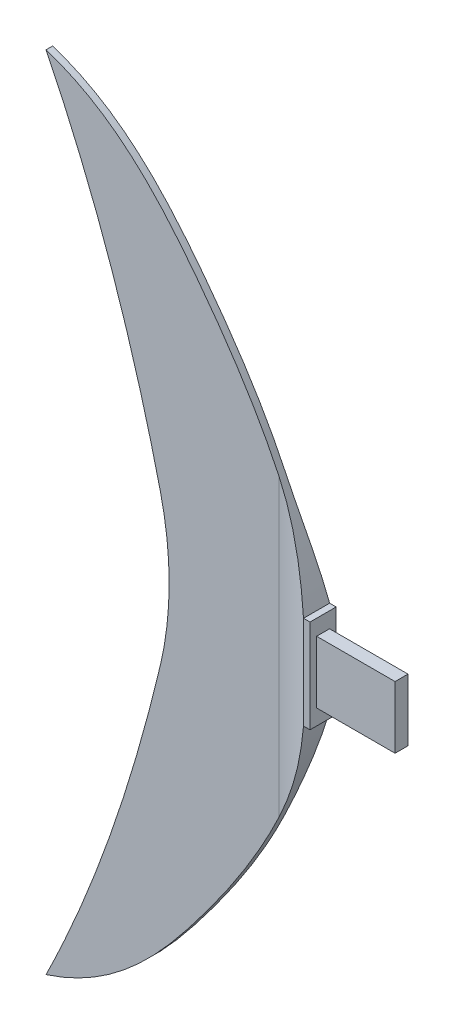
ISO-10303-21;
HEADER;
FILE_DESCRIPTION(('STEP AP214'),'2;1');
FILE_NAME('part.step','',(''),(''),'','','');
FILE_SCHEMA(('AUTOMOTIVE_DESIGN { 1 0 10303 214 1 1 1 1 }'));
ENDSEC;
DATA;
#1=APPLICATION_CONTEXT('core data for automotive mechanical design processes');
#2=APPLICATION_PROTOCOL_DEFINITION('international standard','automotive_design',2000,#1);
#3=PRODUCT_CONTEXT('',#1,'mechanical');
#4=PRODUCT('Part','Part','',(#3));
#5=PRODUCT_RELATED_PRODUCT_CATEGORY('part','',(#4));
#6=PRODUCT_DEFINITION_FORMATION('','',#4);
#7=PRODUCT_DEFINITION_CONTEXT('part definition',#1,'design');
#8=PRODUCT_DEFINITION('design','',#6,#7);
#9=PRODUCT_DEFINITION_SHAPE('','',#8);
#10=(LENGTH_UNIT() NAMED_UNIT(*) SI_UNIT(.MILLI.,.METRE.));
#11=(NAMED_UNIT(*) PLANE_ANGLE_UNIT() SI_UNIT($,.RADIAN.));
#12=(NAMED_UNIT(*) SI_UNIT($,.STERADIAN.) SOLID_ANGLE_UNIT());
#13=UNCERTAINTY_MEASURE_WITH_UNIT(LENGTH_MEASURE(1.E-05),#10,'distance_accuracy_value','');
#14=(GEOMETRIC_REPRESENTATION_CONTEXT(3) GLOBAL_UNCERTAINTY_ASSIGNED_CONTEXT((#13)) GLOBAL_UNIT_ASSIGNED_CONTEXT((#10,
#11,#12)) REPRESENTATION_CONTEXT('',''));
#15=CARTESIAN_POINT('',(0.,0.,0.));
#16=DIRECTION('',(0.,0.,1.));
#17=DIRECTION('',(1.,0.,0.));
#18=AXIS2_PLACEMENT_3D('',#15,#16,#17);
#19=CARTESIAN_POINT('',(-41.875,-61.25,-0.5));
#20=CARTESIAN_POINT('',(-31.5874842784891,-57.9418836886526,-0.5));
#21=CARTESIAN_POINT('',(-14.3282682069609,-38.8723925230589,-0.5));
#22=CARTESIAN_POINT('',(-1.21117209617891,-16.1164014084701,-0.5));
#23=CARTESIAN_POINT('',(0.,0.,-0.5));
#24=B_SPLINE_CURVE_WITH_KNOTS('',3,(#19,#20,#21,#22,#23),.UNSPECIFIED.,.F.,.F.,(4,1,4),(0.,
0.390169789685877,1.),.UNSPECIFIED.);
#25=DIRECTION('',(0.,0.,1.));
#26=VECTOR('',#25,1.);
#27=SURFACE_OF_LINEAR_EXTRUSION('',#24,#26);
#28=CARTESIAN_POINT('',(-41.875,-61.25,-0.5));
#29=VERTEX_POINT('',#28);
#30=CARTESIAN_POINT('',(-6.26035934816506,-22.6217568444581,-0.5));
#31=VERTEX_POINT('',#30);
#32=EDGE_CURVE('E253',#29,#31,#24,.T.);
#33=ORIENTED_EDGE('',*,*,#32,.T.);
#34=CARTESIAN_POINT('',(-6.26035934021112,-22.6217568482344,-0.5));
#35=CARTESIAN_POINT('',(-6.06303837023028,-22.2061514161493,-0.500008799848662));
#36=CARTESIAN_POINT('',(-5.8692962912311,-21.7888749438555,-0.505839641256225));
#37=CARTESIAN_POINT('',(-5.48991552133412,-20.9524460311061,-0.527916298525936));
#38=CARTESIAN_POINT('',(-5.30425408966573,-20.5333030843551,-0.544130554403684));
#39=CARTESIAN_POINT('',(-4.94118083785616,-19.6930135175768,-0.585713833233017));
#40=CARTESIAN_POINT('',(-4.76375180606703,-19.27187331416,-0.611062685494451));
#41=CARTESIAN_POINT('',(-4.41728500481613,-18.427449275693,-0.669745518831748));
#42=CARTESIAN_POINT('',(-4.24823510715106,-18.0041695779003,-0.703067526172686));
#43=CARTESIAN_POINT('',(-3.91867867166206,-17.155330578039,-0.776574308453235));
#44=CARTESIAN_POINT('',(-3.75816465229777,-16.7297736444612,-0.816752939179432));
#45=CARTESIAN_POINT('',(-3.44583812336753,-15.8762421683627,-0.902880570729147));
#46=CARTESIAN_POINT('',(-3.29402241294207,-15.4482685796588,-0.948827428801874));
#47=CARTESIAN_POINT('',(-2.99933800040708,-14.5899974922843,-1.04538374202225));
#48=CARTESIAN_POINT('',(-2.85646525584853,-14.1597011405151,-1.0959910645793));
#49=CARTESIAN_POINT('',(-2.57973544765812,-13.2963687566669,-1.20081121305003));
#50=CARTESIAN_POINT('',(-2.44588384139626,-12.8633312365269,-1.25502618270716));
#51=CARTESIAN_POINT('',(-2.18736672561728,-11.9943293327164,-1.36596821901394));
#52=CARTESIAN_POINT('',(-2.06271123893371,-11.5583623045509,-1.42269792177025));
#53=CARTESIAN_POINT('',(-1.82276785450447,-10.6833080099514,-1.5375504912027));
#54=CARTESIAN_POINT('',(-1.7074946561631,-10.2442169763599,-1.59567536602246));
#55=CARTESIAN_POINT('',(-1.48650952551611,-9.36271212395287,-1.7121682728485));
#56=CARTESIAN_POINT('',(-1.38081726807849,-8.92029340170838,-1.77053655876187));
#57=CARTESIAN_POINT('',(-1.17919938142418,-8.03192766807165,-1.8863260311618));
#58=CARTESIAN_POINT('',(-1.08329892510835,-7.58597458887117,-1.94374447357079));
#59=CARTESIAN_POINT('',(-0.992532463784746,-7.13882445,-2.));
#60=B_SPLINE_CURVE_WITH_KNOTS('',3,(#34,#35,#36,#37,#38,#39,#40,#41,#42,#43,#44,#45,#46,#47,#48,
#49,#50,#51,#52,#53,#54,#55,#56,#57,#58,#59),.UNSPECIFIED.,.F.,.F.,(4,2,2,2,2,2,2,2,2,2,2,2,4),
(0.,1.38011650132367,2.75605797447415,4.12897957588325,5.4998521830644,6.86950274194032,
8.23864600743303,9.60716584802514,10.9765062832197,12.3473177616643,13.7202371526974,
15.0959148802064,16.4750445958695),.UNSPECIFIED.);
#61=CARTESIAN_POINT('',(-0.992532463784747,-7.13882445,-2.));
#62=VERTEX_POINT('',#61);
#63=EDGE_CURVE('E54',#31,#62,#60,.T.);
#64=ORIENTED_EDGE('',*,*,#63,.T.);
#65=DIRECTION('',(0.,0.,-1.));
#66=VECTOR('',#65,1.);
#67=CARTESIAN_POINT('',(-0.992532463784747,-7.13882445,2.));
#68=LINE('',#67,#66);
#69=CARTESIAN_POINT('',(-0.992532463784747,-7.13882445,2.));
#70=VERTEX_POINT('',#69);
#71=EDGE_CURVE('E187',#70,#62,#68,.T.);
#72=ORIENTED_EDGE('',*,*,#71,.F.);
#73=CARTESIAN_POINT('',(-0.992532463784747,-7.13882445,2.));
#74=CARTESIAN_POINT('',(-1.08329892512268,-7.58597458894179,1.9437444735619));
#75=CARTESIAN_POINT('',(-1.17919938145447,-8.03192766821252,1.88632603114366));
#76=CARTESIAN_POINT('',(-1.38081726814159,-8.92029340197903,1.77053655872637));
#77=CARTESIAN_POINT('',(-1.48650952559583,-9.36271212428311,1.71216827280492));
#78=CARTESIAN_POINT('',(-1.70749465627621,-10.2442169767989,1.59567536596439));
#79=CARTESIAN_POINT('',(-1.82276785463412,-10.6833080104396,1.53755049113823));
#80=CARTESIAN_POINT('',(-2.06271123909597,-11.5583623051273,1.42269792169499));
#81=CARTESIAN_POINT('',(-2.18736672579539,-11.9943293333318,1.36596821893429));
#82=CARTESIAN_POINT('',(-2.44588384160459,-12.8633312372105,1.25502618262097));
#83=CARTESIAN_POINT('',(-2.5797354478806,-13.2963687573797,1.20081121296163));
#84=CARTESIAN_POINT('',(-2.85646525609843,-14.159701141276,1.09599106448877));
#85=CARTESIAN_POINT('',(-2.99933800067002,-14.5899974930642,1.04538374193172));
#86=CARTESIAN_POINT('',(-3.29402241323577,-15.4482685805001,0.948827428710009));
#87=CARTESIAN_POINT('',(-3.44583812367941,-15.8762421692463,0.902880570636185));
#88=CARTESIAN_POINT('',(-3.75816465266117,-16.7297736454229,0.816752939086188));
#89=CARTESIAN_POINT('',(-3.91867867205883,-17.1553305790365,0.77657430836081));
#90=CARTESIAN_POINT('',(-4.24823510756566,-18.0041695789927,0.703067526084143));
#91=CARTESIAN_POINT('',(-4.41728500521516,-18.4274492768445,0.669745518746279));
#92=CARTESIAN_POINT('',(-4.76375180662571,-19.2718733153424,0.611062685417736));
#93=CARTESIAN_POINT('',(-4.94118083859035,-19.6930135187305,0.585713833162002));
#94=CARTESIAN_POINT('',(-5.30425409004542,-20.5333030857805,0.5441305543471));
#95=CARTESIAN_POINT('',(-5.48991552118228,-20.9524460328323,0.527916298478112));
#96=CARTESIAN_POINT('',(-5.86929629272279,-21.788874945077,0.505839641226235));
#97=CARTESIAN_POINT('',(-6.06303837390731,-22.2061514165606,0.50000879983085));
#98=CARTESIAN_POINT('',(-6.26035934910116,-22.6217568464297,0.499999999999998));
#99=B_SPLINE_CURVE_WITH_KNOTS('',3,(#73,#74,#75,#76,#77,#78,#79,#80,#81,#82,#83,#84,#85,#86,#87,
#88,#89,#90,#91,#92,#93,#94,#95,#96,#97,#98),.UNSPECIFIED.,.F.,.F.,(4,2,2,2,2,2,2,2,2,2,2,2,4),
(0.,1.37912971588096,2.75480744357691,4.12772683476659,5.49853831333752,6.86787874862828,
8.23639858928663,9.60554185491593,10.9751924139293,12.3460650212497,13.7189866228008,
15.094928096097,16.4750445979756),.UNSPECIFIED.);
#100=CARTESIAN_POINT('',(-6.26035934816506,-22.6217568444581,0.5));
#101=VERTEX_POINT('',#100);
#102=EDGE_CURVE('E224',#70,#101,#99,.T.);
#103=ORIENTED_EDGE('',*,*,#102,.T.);
#104=CARTESIAN_POINT('',(-41.875,-61.25,0.5));
#105=CARTESIAN_POINT('',(-31.5874842784891,-57.9418836886526,0.5));
#106=CARTESIAN_POINT('',(-14.3282682069609,-38.8723925230589,0.5));
#107=CARTESIAN_POINT('',(-1.21117209617891,-16.1164014084701,0.5));
#108=CARTESIAN_POINT('',(0.,0.,0.5));
#109=B_SPLINE_CURVE_WITH_KNOTS('',3,(#104,#105,#106,#107,#108),.UNSPECIFIED.,.F.,.F.,(4,1,4),
(0.,0.390169789685877,1.),.UNSPECIFIED.);
#110=CARTESIAN_POINT('',(-41.875,-61.25,0.5));
#111=VERTEX_POINT('',#110);
#112=EDGE_CURVE('E313',#111,#101,#109,.T.);
#113=ORIENTED_EDGE('',*,*,#112,.F.);
#114=DIRECTION('',(0.,0.,1.));
#115=VECTOR('',#114,1.);
#116=CARTESIAN_POINT('',(-41.875,-61.25,-0.5));
#117=LINE('',#116,#115);
#118=EDGE_CURVE('E225',#29,#111,#117,.T.);
#119=ORIENTED_EDGE('',*,*,#118,.F.);
#120=EDGE_LOOP('',(#33,#64,#72,#103,#113,#119));
#121=FACE_BOUND('',#120,.T.);
#122=ADVANCED_FACE('F39',(#121),#27,.T.);
#123=CARTESIAN_POINT('',(-13.7762997545123,35.6043763939618,-0.5));
#124=DIRECTION('',(0.,0.,-1.));
#125=DIRECTION('',(-1.,0.,0.));
#126=AXIS2_PLACEMENT_3D('',#123,#124,#125);
#127=PLANE('',#126);
#128=CARTESIAN_POINT('',(0.,0.,-0.5));
#129=CARTESIAN_POINT('',(-1.21117209617891,16.1164014084701,-0.5));
#130=CARTESIAN_POINT('',(-14.3282682069609,38.8723925230589,-0.5));
#131=CARTESIAN_POINT('',(-31.5874842784891,57.9418836886526,-0.5));
#132=CARTESIAN_POINT('',(-41.875,61.25,-0.5));
#133=B_SPLINE_CURVE_WITH_KNOTS('',3,(#128,#129,#130,#131,#132),.UNSPECIFIED.,.F.,.F.,(4,1,4),
(0.,0.609830210314123,1.),.UNSPECIFIED.);
#134=CARTESIAN_POINT('',(-6.26035934816506,22.6217568444581,-0.5));
#135=VERTEX_POINT('',#134);
#136=CARTESIAN_POINT('',(-41.875,61.25,-0.5));
#137=VERTEX_POINT('',#136);
#138=EDGE_CURVE('E287',#135,#137,#133,.T.);
#139=ORIENTED_EDGE('',*,*,#138,.F.);
#140=DIRECTION('',(0.,-1.,0.));
#141=VECTOR('',#140,1.);
#142=CARTESIAN_POINT('',(-6.26035934021112,-7.13882445,-0.5));
#143=LINE('',#142,#141);
#144=EDGE_CURVE('E341',#135,#31,#143,.T.);
#145=ORIENTED_EDGE('',*,*,#144,.T.);
#146=ORIENTED_EDGE('',*,*,#32,.F.);
#147=CARTESIAN_POINT('',(-24.394942865658,-11.568495118866,-0.5));
#148=CARTESIAN_POINT('',(-25.165989031182,-14.8105956598279,-0.5));
#149=CARTESIAN_POINT('',(-29.5198745715321,-31.8488736606936,-0.5));
#150=CARTESIAN_POINT('',(-35.5359887184975,-48.4642236362872,-0.5));
#151=CARTESIAN_POINT('',(-41.875,-61.25,-0.5));
#152=B_SPLINE_CURVE_WITH_KNOTS('',3,(#147,#148,#149,#150,#151),.UNSPECIFIED.,.F.,.F.,(4,1,4),
(0.183312398407594,0.338004493417248,1.),.UNSPECIFIED.);
#153=CARTESIAN_POINT('',(-24.394942865658,-11.568495118866,-0.5));
#154=VERTEX_POINT('',#153);
#155=EDGE_CURVE('E260',#154,#29,#152,.T.);
#156=ORIENTED_EDGE('',*,*,#155,.F.);
#157=CARTESIAN_POINT('',(-73.0382355244077,0.,-0.5));
#158=DIRECTION('',(0.,0.,-1.));
#159=DIRECTION('',(1.,0.,0.));
#160=AXIS2_PLACEMENT_3D('',#157,#158,#159);
#161=CIRCLE('',#160,50.);
#162=CARTESIAN_POINT('',(-24.3949428656579,11.5684951188659,-0.5));
#163=VERTEX_POINT('',#162);
#164=EDGE_CURVE('E390',#163,#154,#161,.T.);
#165=ORIENTED_EDGE('',*,*,#164,.F.);
#166=CARTESIAN_POINT('',(-41.875,61.25,-0.5));
#167=CARTESIAN_POINT('',(-35.5359887184975,48.4642236362872,-0.5));
#168=CARTESIAN_POINT('',(-29.5198745715322,31.8488736606936,-0.5));
#169=CARTESIAN_POINT('',(-25.1659890311819,14.8105956598279,-0.5));
#170=CARTESIAN_POINT('',(-24.3949428656579,11.5684951188659,-0.5));
#171=B_SPLINE_CURVE_WITH_KNOTS('',3,(#166,#167,#168,#169,#170),.UNSPECIFIED.,.F.,.F.,(4,1,4),
(0.183312398407593,0.845307904990346,1.),.UNSPECIFIED.);
#172=EDGE_CURVE('E329',#137,#163,#171,.T.);
#173=ORIENTED_EDGE('',*,*,#172,.F.);
#174=EDGE_LOOP('',(#139,#145,#146,#156,#165,#173));
#175=FACE_BOUND('',#174,.T.);
#176=ADVANCED_FACE('F246',(#175),#127,.T.);
#177=CARTESIAN_POINT('',(-13.7762997545123,35.6043763939618,0.5));
#178=DIRECTION('',(0.,0.,-1.));
#179=DIRECTION('',(-1.,0.,0.));
#180=AXIS2_PLACEMENT_3D('',#177,#178,#179);
#181=PLANE('',#180);
#182=ORIENTED_EDGE('',*,*,#112,.T.);
#183=DIRECTION('',(0.,-1.,0.));
#184=VECTOR('',#183,1.);
#185=CARTESIAN_POINT('',(-6.26035934021112,35.6043763939618,0.5));
#186=LINE('',#185,#184);
#187=CARTESIAN_POINT('',(-6.26035934816506,22.621756844458,0.5));
#188=VERTEX_POINT('',#187);
#189=EDGE_CURVE('E221',#101,#188,#186,.F.);
#190=ORIENTED_EDGE('',*,*,#189,.T.);
#191=CARTESIAN_POINT('',(0.,0.,0.5));
#192=CARTESIAN_POINT('',(-1.21117209617891,16.1164014084701,0.5));
#193=CARTESIAN_POINT('',(-14.3282682069609,38.8723925230589,0.5));
#194=CARTESIAN_POINT('',(-31.5874842784891,57.9418836886526,0.5));
#195=CARTESIAN_POINT('',(-41.875,61.25,0.5));
#196=B_SPLINE_CURVE_WITH_KNOTS('',3,(#191,#192,#193,#194,#195),.UNSPECIFIED.,.F.,.F.,(4,1,4),
(0.,0.609830210314123,1.),.UNSPECIFIED.);
#197=CARTESIAN_POINT('',(-41.875,61.25,0.5));
#198=VERTEX_POINT('',#197);
#199=EDGE_CURVE('E207',#188,#198,#196,.T.);
#200=ORIENTED_EDGE('',*,*,#199,.T.);
#201=CARTESIAN_POINT('',(-41.875,61.25,0.5));
#202=CARTESIAN_POINT('',(-35.5359887184975,48.4642236362872,0.5));
#203=CARTESIAN_POINT('',(-29.5198745715322,31.8488736606936,0.5));
#204=CARTESIAN_POINT('',(-25.1659890311819,14.8105956598279,0.5));
#205=CARTESIAN_POINT('',(-24.3949428656579,11.5684951188659,0.5));
#206=B_SPLINE_CURVE_WITH_KNOTS('',3,(#201,#202,#203,#204,#205),.UNSPECIFIED.,.F.,.F.,(4,1,4),
(0.183312398407593,0.845307904990346,1.),.UNSPECIFIED.);
#207=CARTESIAN_POINT('',(-24.3949428656579,11.5684951188659,0.5));
#208=VERTEX_POINT('',#207);
#209=EDGE_CURVE('E220',#198,#208,#206,.T.);
#210=ORIENTED_EDGE('',*,*,#209,.T.);
#211=CARTESIAN_POINT('',(-73.0382355244077,0.,0.5));
#212=DIRECTION('',(0.,0.,-1.));
#213=DIRECTION('',(1.,0.,0.));
#214=AXIS2_PLACEMENT_3D('',#211,#212,#213);
#215=CIRCLE('',#214,50.);
#216=CARTESIAN_POINT('',(-24.394942865658,-11.568495118866,0.5));
#217=VERTEX_POINT('',#216);
#218=EDGE_CURVE('E294',#208,#217,#215,.T.);
#219=ORIENTED_EDGE('',*,*,#218,.T.);
#220=CARTESIAN_POINT('',(-24.394942865658,-11.568495118866,0.5));
#221=CARTESIAN_POINT('',(-25.165989031182,-14.8105956598279,0.5));
#222=CARTESIAN_POINT('',(-29.5198745715321,-31.8488736606936,0.5));
#223=CARTESIAN_POINT('',(-35.5359887184975,-48.4642236362872,0.5));
#224=CARTESIAN_POINT('',(-41.875,-61.25,0.5));
#225=B_SPLINE_CURVE_WITH_KNOTS('',3,(#220,#221,#222,#223,#224),.UNSPECIFIED.,.F.,.F.,(4,1,4),
(0.183312398407594,0.338004493417248,1.),.UNSPECIFIED.);
#226=EDGE_CURVE('E297',#217,#111,#225,.T.);
#227=ORIENTED_EDGE('',*,*,#226,.T.);
#228=EDGE_LOOP('',(#182,#190,#200,#210,#219,#227));
#229=FACE_BOUND('',#228,.T.);
#230=ADVANCED_FACE('F381',(#229),#181,.F.);
#231=DIRECTION('',(0.,0.,1.));
#232=VECTOR('',#231,1.);
#233=SURFACE_OF_LINEAR_EXTRUSION('',#133,#232);
#234=DIRECTION('',(0.,0.,1.));
#235=VECTOR('',#234,1.);
#236=CARTESIAN_POINT('',(-0.992532463784747,7.13882445,-0.5));
#237=LINE('',#236,#235);
#238=CARTESIAN_POINT('',(-0.992532463784747,7.13882445,2.));
#239=VERTEX_POINT('',#238);
#240=CARTESIAN_POINT('',(-0.992532463784747,7.13882445,-2.));
#241=VERTEX_POINT('',#240);
#242=EDGE_CURVE('E203',#239,#241,#237,.F.);
#243=ORIENTED_EDGE('',*,*,#242,.T.);
#244=CARTESIAN_POINT('',(-0.992532463784747,7.13882445,-2.));
#245=CARTESIAN_POINT('',(-1.08329892512268,7.58597458894179,-1.94374447356189));
#246=CARTESIAN_POINT('',(-1.17919938145447,8.03192766821252,-1.88632603114366));
#247=CARTESIAN_POINT('',(-1.3808172681416,8.92029340197903,-1.77053655872637));
#248=CARTESIAN_POINT('',(-1.48650952559583,9.36271212428311,-1.71216827280492));
#249=CARTESIAN_POINT('',(-1.70749465627621,10.2442169767989,-1.59567536596438));
#250=CARTESIAN_POINT('',(-1.82276785463412,10.6833080104396,-1.53755049113822));
#251=CARTESIAN_POINT('',(-2.06271123909597,11.5583623051273,-1.42269792169499));
#252=CARTESIAN_POINT('',(-2.18736672579539,11.9943293333318,-1.36596821893429));
#253=CARTESIAN_POINT('',(-2.44588384160459,12.8633312372105,-1.25502618262096));
#254=CARTESIAN_POINT('',(-2.5797354478806,13.2963687573797,-1.20081121296163));
#255=CARTESIAN_POINT('',(-2.85646525609843,14.159701141276,-1.09599106448877));
#256=CARTESIAN_POINT('',(-2.99933800067002,14.5899974930642,-1.04538374193172));
#257=CARTESIAN_POINT('',(-3.29402241323578,15.4482685805001,-0.948827428710006));
#258=CARTESIAN_POINT('',(-3.44583812367941,15.8762421692463,-0.902880570636182));
#259=CARTESIAN_POINT('',(-3.75816465266117,16.7297736454229,-0.816752939086185));
#260=CARTESIAN_POINT('',(-3.91867867205883,17.1553305790365,-0.776574308360807));
#261=CARTESIAN_POINT('',(-4.24823510756566,18.0041695789927,-0.70306752608414));
#262=CARTESIAN_POINT('',(-4.41728500521516,18.4274492768445,-0.669745518746275));
#263=CARTESIAN_POINT('',(-4.76375180662571,19.2718733153424,-0.611062685417733));
#264=CARTESIAN_POINT('',(-4.94118083859035,19.6930135187305,-0.585713833161999));
#265=CARTESIAN_POINT('',(-5.30425409004542,20.5333030857805,-0.544130554347096));
#266=CARTESIAN_POINT('',(-5.48991552118228,20.9524460328323,-0.527916298478109));
#267=CARTESIAN_POINT('',(-5.86929629272279,21.788874945077,-0.505839641226232));
#268=CARTESIAN_POINT('',(-6.06303837390731,22.2061514165607,-0.500008799830847));
#269=CARTESIAN_POINT('',(-6.26035934910116,22.6217568464297,-0.499999999999996));
#270=B_SPLINE_CURVE_WITH_KNOTS('',3,(#244,#245,#246,#247,#248,#249,#250,#251,#252,#253,#254,
#255,#256,#257,#258,#259,#260,#261,#262,#263,#264,#265,#266,#267,#268,#269),.UNSPECIFIED.,.F.,
.F.,(4,2,2,2,2,2,2,2,2,2,2,2,4),(0.,1.37912971588096,2.75480744357691,4.12772683476659,
5.49853831333752,6.86787874862828,8.23639858928663,9.60554185491593,10.9751924139293,
12.3460650212497,13.7189866228008,15.094928096097,16.4750445979756),.UNSPECIFIED.);
#271=EDGE_CURVE('E11',#241,#135,#270,.T.);
#272=ORIENTED_EDGE('',*,*,#271,.T.);
#273=ORIENTED_EDGE('',*,*,#138,.T.);
#274=DIRECTION('',(0.,0.,1.));
#275=VECTOR('',#274,1.);
#276=CARTESIAN_POINT('',(-41.875,61.25,-0.5));
#277=LINE('',#276,#275);
#278=EDGE_CURVE('E209',#137,#198,#277,.T.);
#279=ORIENTED_EDGE('',*,*,#278,.T.);
#280=ORIENTED_EDGE('',*,*,#199,.F.);
#281=CARTESIAN_POINT('',(-6.26035934021112,22.6217568482343,0.5));
#282=CARTESIAN_POINT('',(-6.06303837023027,22.2061514161493,0.500008799848664));
#283=CARTESIAN_POINT('',(-5.8692962912311,21.7888749438555,0.505839641256228));
#284=CARTESIAN_POINT('',(-5.48991552133412,20.9524460311061,0.52791629852594));
#285=CARTESIAN_POINT('',(-5.30425408966573,20.5333030843551,0.544130554403688));
#286=CARTESIAN_POINT('',(-4.94118083785616,19.6930135175768,0.585713833233021));
#287=CARTESIAN_POINT('',(-4.76375180606703,19.27187331416,0.611062685494455));
#288=CARTESIAN_POINT('',(-4.41728500481612,18.427449275693,0.669745518831752));
#289=CARTESIAN_POINT('',(-4.24823510715106,18.0041695779003,0.70306752617269));
#290=CARTESIAN_POINT('',(-3.91867867166206,17.155330578039,0.776574308453239));
#291=CARTESIAN_POINT('',(-3.75816465229777,16.7297736444612,0.816752939179436));
#292=CARTESIAN_POINT('',(-3.44583812336753,15.8762421683627,0.902880570729151));
#293=CARTESIAN_POINT('',(-3.29402241294207,15.4482685796588,0.948827428801878));
#294=CARTESIAN_POINT('',(-2.99933800040708,14.5899974922843,1.04538374202225));
#295=CARTESIAN_POINT('',(-2.85646525584853,14.1597011405151,1.0959910645793));
#296=CARTESIAN_POINT('',(-2.57973544765812,13.2963687566669,1.20081121305004));
#297=CARTESIAN_POINT('',(-2.44588384139626,12.8633312365269,1.25502618270716));
#298=CARTESIAN_POINT('',(-2.18736672561728,11.9943293327164,1.36596821901394));
#299=CARTESIAN_POINT('',(-2.06271123893371,11.5583623045509,1.42269792177025));
#300=CARTESIAN_POINT('',(-1.82276785450447,10.6833080099514,1.53755049120271));
#301=CARTESIAN_POINT('',(-1.7074946561631,10.2442169763599,1.59567536602246));
#302=CARTESIAN_POINT('',(-1.48650952551611,9.36271212395287,1.71216827284851));
#303=CARTESIAN_POINT('',(-1.38081726807849,8.92029340170838,1.77053655876187));
#304=CARTESIAN_POINT('',(-1.17919938142418,8.03192766807165,1.88632603116181));
#305=CARTESIAN_POINT('',(-1.08329892510835,7.58597458887117,1.94374447357079));
#306=CARTESIAN_POINT('',(-0.992532463784747,7.13882445,2.));
#307=B_SPLINE_CURVE_WITH_KNOTS('',3,(#281,#282,#283,#284,#285,#286,#287,#288,#289,#290,#291,
#292,#293,#294,#295,#296,#297,#298,#299,#300,#301,#302,#303,#304,#305,#306),.UNSPECIFIED.,.F.,
.F.,(4,2,2,2,2,2,2,2,2,2,2,2,4),(0.,1.38011650132367,2.75605797447415,4.12897957588325,
5.4998521830644,6.86950274194032,8.23864600743302,9.60716584802513,10.9765062832197,
12.3473177616643,13.7202371526974,15.0959148802064,16.4750445958695),.UNSPECIFIED.);
#308=EDGE_CURVE('E233',#188,#239,#307,.T.);
#309=ORIENTED_EDGE('',*,*,#308,.T.);
#310=EDGE_LOOP('',(#243,#272,#273,#279,#280,#309));
#311=FACE_BOUND('',#310,.T.);
#312=ADVANCED_FACE('F283',(#311),#233,.T.);
#313=DIRECTION('',(0.,0.,1.));
#314=VECTOR('',#313,1.);
#315=SURFACE_OF_LINEAR_EXTRUSION('',#152,#314);
#316=ORIENTED_EDGE('',*,*,#118,.T.);
#317=ORIENTED_EDGE('',*,*,#226,.F.);
#318=DIRECTION('',(0.,0.,1.));
#319=VECTOR('',#318,1.);
#320=CARTESIAN_POINT('',(-24.394942865658,-11.568495118866,-0.5));
#321=LINE('',#320,#319);
#322=EDGE_CURVE('E270',#154,#217,#321,.T.);
#323=ORIENTED_EDGE('',*,*,#322,.F.);
#324=ORIENTED_EDGE('',*,*,#155,.T.);
#325=EDGE_LOOP('',(#316,#317,#323,#324));
#326=FACE_BOUND('',#325,.T.);
#327=ADVANCED_FACE('F249',(#326),#315,.T.);
#328=CARTESIAN_POINT('',(-73.0382355244077,0.,-0.5));
#329=DIRECTION('',(0.,0.,1.));
#330=DIRECTION('',(1.,0.,0.));
#331=AXIS2_PLACEMENT_3D('',#328,#329,#330);
#332=CYLINDRICAL_SURFACE('',#331,50.);
#333=ORIENTED_EDGE('',*,*,#322,.T.);
#334=ORIENTED_EDGE('',*,*,#218,.F.);
#335=DIRECTION('',(0.,0.,1.));
#336=VECTOR('',#335,1.);
#337=CARTESIAN_POINT('',(-24.3949428656579,11.5684951188659,-0.5));
#338=LINE('',#337,#336);
#339=EDGE_CURVE('E272',#163,#208,#338,.T.);
#340=ORIENTED_EDGE('',*,*,#339,.F.);
#341=ORIENTED_EDGE('',*,*,#164,.T.);
#342=EDGE_LOOP('',(#333,#334,#340,#341));
#343=FACE_BOUND('',#342,.T.);
#344=ADVANCED_FACE('F394',(#343),#332,.F.);
#345=DIRECTION('',(0.,0.,1.));
#346=VECTOR('',#345,1.);
#347=SURFACE_OF_LINEAR_EXTRUSION('',#171,#346);
#348=ORIENTED_EDGE('',*,*,#339,.T.);
#349=ORIENTED_EDGE('',*,*,#209,.F.);
#350=ORIENTED_EDGE('',*,*,#278,.F.);
#351=ORIENTED_EDGE('',*,*,#172,.T.);
#352=EDGE_LOOP('',(#348,#349,#350,#351));
#353=FACE_BOUND('',#352,.T.);
#354=ADVANCED_FACE('F289',(#353),#347,.T.);
#355=CARTESIAN_POINT('',(0.,0.,0.));
#356=DIRECTION('',(1.,0.,0.));
#357=DIRECTION('',(0.,0.,-1.));
#358=AXIS2_PLACEMENT_3D('',#355,#356,#357);
#359=PLANE('',#358);
#360=DIRECTION('',(0.,1.,0.));
#361=VECTOR('',#360,1.);
#362=CARTESIAN_POINT('',(0.,4.75,-0.988252263565081));
#363=LINE('',#362,#361);
#364=CARTESIAN_POINT('',(0.,-4.75,-0.988252263565082));
#365=VERTEX_POINT('',#364);
#366=CARTESIAN_POINT('',(0.,4.75,-0.988252263565081));
#367=VERTEX_POINT('',#366);
#368=EDGE_CURVE('E61',#365,#367,#363,.T.);
#369=ORIENTED_EDGE('',*,*,#368,.F.);
#370=DIRECTION('',(0.,0.,-1.));
#371=VECTOR('',#370,1.);
#372=CARTESIAN_POINT('',(0.,-4.75,0.988252263565081));
#373=LINE('',#372,#371);
#374=CARTESIAN_POINT('',(0.,-4.75,0.988252263565081));
#375=VERTEX_POINT('',#374);
#376=EDGE_CURVE('E65',#375,#365,#373,.T.);
#377=ORIENTED_EDGE('',*,*,#376,.F.);
#378=DIRECTION('',(0.,-1.,0.));
#379=VECTOR('',#378,1.);
#380=CARTESIAN_POINT('',(0.,4.75,0.988252263565082));
#381=LINE('',#380,#379);
#382=CARTESIAN_POINT('',(0.,4.75,0.988252263565082));
#383=VERTEX_POINT('',#382);
#384=EDGE_CURVE('E571',#383,#375,#381,.T.);
#385=ORIENTED_EDGE('',*,*,#384,.F.);
#386=DIRECTION('',(0.,0.,1.));
#387=VECTOR('',#386,1.);
#388=CARTESIAN_POINT('',(0.,4.75,0.988252263565082));
#389=LINE('',#388,#387);
#390=EDGE_CURVE('E581',#367,#383,#389,.T.);
#391=ORIENTED_EDGE('',*,*,#390,.F.);
#392=EDGE_LOOP('',(#369,#377,#385,#391));
#393=FACE_BOUND('',#392,.T.);
#394=DIRECTION('',(0.,-1.,0.));
#395=VECTOR('',#394,1.);
#396=CARTESIAN_POINT('',(0.,7.13882445,2.));
#397=LINE('',#396,#395);
#398=CARTESIAN_POINT('',(0.,7.13882445,2.));
#399=VERTEX_POINT('',#398);
#400=CARTESIAN_POINT('',(0.,-7.13882445,2.));
#401=VERTEX_POINT('',#400);
#402=EDGE_CURVE('E370',#399,#401,#397,.T.);
#403=ORIENTED_EDGE('',*,*,#402,.T.);
#404=DIRECTION('',(0.,0.,-1.));
#405=VECTOR('',#404,1.);
#406=CARTESIAN_POINT('',(0.,-7.13882445,2.));
#407=LINE('',#406,#405);
#408=CARTESIAN_POINT('',(0.,-7.13882445,-2.));
#409=VERTEX_POINT('',#408);
#410=EDGE_CURVE('E169',#401,#409,#407,.T.);
#411=ORIENTED_EDGE('',*,*,#410,.T.);
#412=DIRECTION('',(0.,1.,0.));
#413=VECTOR('',#412,1.);
#414=CARTESIAN_POINT('',(0.,7.13882445,-2.));
#415=LINE('',#414,#413);
#416=CARTESIAN_POINT('',(0.,7.13882445,-2.));
#417=VERTEX_POINT('',#416);
#418=EDGE_CURVE('E195',#409,#417,#415,.T.);
#419=ORIENTED_EDGE('',*,*,#418,.T.);
#420=DIRECTION('',(0.,0.,1.));
#421=VECTOR('',#420,1.);
#422=CARTESIAN_POINT('',(0.,7.13882445,2.));
#423=LINE('',#422,#421);
#424=EDGE_CURVE('E371',#417,#399,#423,.T.);
#425=ORIENTED_EDGE('',*,*,#424,.T.);
#426=EDGE_LOOP('',(#403,#411,#419,#425));
#427=FACE_BOUND('',#426,.T.);
#428=ADVANCED_FACE('F366',(#393,#427),#359,.T.);
#429=CARTESIAN_POINT('',(-41.876,7.13882445,2.));
#430=DIRECTION('',(0.,1.,0.));
#431=DIRECTION('',(0.,0.,1.));
#432=AXIS2_PLACEMENT_3D('',#429,#430,#431);
#433=PLANE('',#432);
#434=ORIENTED_EDGE('',*,*,#242,.F.);
#435=DIRECTION('',(1.,0.,0.));
#436=VECTOR('',#435,1.);
#437=CARTESIAN_POINT('',(-41.876,7.13882445,2.));
#438=LINE('',#437,#436);
#439=EDGE_CURVE('E208',#239,#399,#438,.T.);
#440=ORIENTED_EDGE('',*,*,#439,.T.);
#441=ORIENTED_EDGE('',*,*,#424,.F.);
#442=DIRECTION('',(1.,0.,0.));
#443=VECTOR('',#442,1.);
#444=CARTESIAN_POINT('',(-41.876,7.13882445,-2.));
#445=LINE('',#444,#443);
#446=EDGE_CURVE('E302',#241,#417,#445,.T.);
#447=ORIENTED_EDGE('',*,*,#446,.F.);
#448=EDGE_LOOP('',(#434,#440,#441,#447));
#449=FACE_BOUND('',#448,.T.);
#450=ADVANCED_FACE('F412',(#449),#433,.T.);
#451=CARTESIAN_POINT('',(-41.876,7.13882445,2.));
#452=DIRECTION('',(0.,0.,1.));
#453=DIRECTION('',(0.,-1.,0.));
#454=AXIS2_PLACEMENT_3D('',#451,#452,#453);
#455=PLANE('',#454);
#456=ORIENTED_EDGE('',*,*,#439,.F.);
#457=DIRECTION('',(0.,-1.,0.));
#458=VECTOR('',#457,1.);
#459=CARTESIAN_POINT('',(-0.992532463784747,7.13882445,2.));
#460=LINE('',#459,#458);
#461=EDGE_CURVE('E183',#239,#70,#460,.T.);
#462=ORIENTED_EDGE('',*,*,#461,.T.);
#463=DIRECTION('',(1.,0.,0.));
#464=VECTOR('',#463,1.);
#465=CARTESIAN_POINT('',(-0.992532463784747,-7.13882445,2.));
#466=LINE('',#465,#464);
#467=EDGE_CURVE('E189',#70,#401,#466,.T.);
#468=ORIENTED_EDGE('',*,*,#467,.T.);
#469=ORIENTED_EDGE('',*,*,#402,.F.);
#470=EDGE_LOOP('',(#456,#462,#468,#469));
#471=FACE_BOUND('',#470,.T.);
#472=ADVANCED_FACE('F376',(#471),#455,.T.);
#473=CARTESIAN_POINT('',(-41.876,7.13882445,-2.));
#474=DIRECTION('',(0.,0.,-1.));
#475=DIRECTION('',(0.,1.,0.));
#476=AXIS2_PLACEMENT_3D('',#473,#474,#475);
#477=PLANE('',#476);
#478=ORIENTED_EDGE('',*,*,#418,.F.);
#479=DIRECTION('',(1.,0.,0.));
#480=VECTOR('',#479,1.);
#481=CARTESIAN_POINT('',(-0.992532463784747,-7.13882445,-2.));
#482=LINE('',#481,#480);
#483=EDGE_CURVE('E191',#62,#409,#482,.T.);
#484=ORIENTED_EDGE('',*,*,#483,.F.);
#485=DIRECTION('',(0.,1.,0.));
#486=VECTOR('',#485,1.);
#487=CARTESIAN_POINT('',(-0.992532463784747,7.13882445,-2.));
#488=LINE('',#487,#486);
#489=EDGE_CURVE('E174',#62,#241,#488,.T.);
#490=ORIENTED_EDGE('',*,*,#489,.T.);
#491=ORIENTED_EDGE('',*,*,#446,.T.);
#492=EDGE_LOOP('',(#478,#484,#490,#491));
#493=FACE_BOUND('',#492,.T.);
#494=ADVANCED_FACE('F358',(#493),#477,.T.);
#495=CARTESIAN_POINT('',(-0.992532463784747,-7.13882445,2.));
#496=DIRECTION('',(0.,-1.,0.));
#497=DIRECTION('',(0.,0.,-1.));
#498=AXIS2_PLACEMENT_3D('',#495,#496,#497);
#499=PLANE('',#498);
#500=ORIENTED_EDGE('',*,*,#410,.F.);
#501=ORIENTED_EDGE('',*,*,#467,.F.);
#502=ORIENTED_EDGE('',*,*,#71,.T.);
#503=ORIENTED_EDGE('',*,*,#483,.T.);
#504=EDGE_LOOP('',(#500,#501,#502,#503));
#505=FACE_BOUND('',#504,.T.);
#506=ADVANCED_FACE('F363',(#505),#499,.T.);
#507=CARTESIAN_POINT('',(-6.26035934021112,0.,10.5));
#508=DIRECTION('',(0.,-1.,0.));
#509=DIRECTION('',(0.,0.,-1.));
#510=AXIS2_PLACEMENT_3D('',#507,#508,#509);
#511=CYLINDRICAL_SURFACE('',#510,10.);
#512=ORIENTED_EDGE('',*,*,#308,.F.);
#513=ORIENTED_EDGE('',*,*,#189,.F.);
#514=ORIENTED_EDGE('',*,*,#102,.F.);
#515=ORIENTED_EDGE('',*,*,#461,.F.);
#516=EDGE_LOOP('',(#512,#513,#514,#515));
#517=FACE_BOUND('',#516,.T.);
#518=ADVANCED_FACE('F239',(#517),#511,.F.);
#519=CARTESIAN_POINT('',(-6.26035934021112,0.,-10.5));
#520=DIRECTION('',(0.,1.,0.));
#521=DIRECTION('',(0.,0.,1.));
#522=AXIS2_PLACEMENT_3D('',#519,#520,#521);
#523=CYLINDRICAL_SURFACE('',#522,10.);
#524=ORIENTED_EDGE('',*,*,#271,.F.);
#525=ORIENTED_EDGE('',*,*,#489,.F.);
#526=ORIENTED_EDGE('',*,*,#63,.F.);
#527=ORIENTED_EDGE('',*,*,#144,.F.);
#528=EDGE_LOOP('',(#524,#525,#526,#527));
#529=FACE_BOUND('',#528,.T.);
#530=ADVANCED_FACE('F41',(#529),#523,.F.);
#531=CARTESIAN_POINT('',(12.,4.75,-0.988252263565081));
#532=DIRECTION('',(0.,0.,1.));
#533=DIRECTION('',(0.,-1.,0.));
#534=AXIS2_PLACEMENT_3D('',#531,#532,#533);
#535=PLANE('',#534);
#536=ORIENTED_EDGE('',*,*,#368,.T.);
#537=DIRECTION('',(-1.,0.,0.));
#538=VECTOR('',#537,1.);
#539=CARTESIAN_POINT('',(12.,4.75,-0.988252263565081));
#540=LINE('',#539,#538);
#541=CARTESIAN_POINT('',(12.,4.75,-0.988252263565081));
#542=VERTEX_POINT('',#541);
#543=EDGE_CURVE('E149',#542,#367,#540,.T.);
#544=ORIENTED_EDGE('',*,*,#543,.F.);
#545=DIRECTION('',(0.,1.,0.));
#546=VECTOR('',#545,1.);
#547=CARTESIAN_POINT('',(12.,4.75,-0.988252263565081));
#548=LINE('',#547,#546);
#549=CARTESIAN_POINT('',(12.,-4.75,-0.988252263565082));
#550=VERTEX_POINT('',#549);
#551=EDGE_CURVE('E156',#550,#542,#548,.T.);
#552=ORIENTED_EDGE('',*,*,#551,.F.);
#553=DIRECTION('',(-1.,0.,0.));
#554=VECTOR('',#553,1.);
#555=CARTESIAN_POINT('',(12.,-4.75,-0.988252263565082));
#556=LINE('',#555,#554);
#557=EDGE_CURVE('E568',#550,#365,#556,.T.);
#558=ORIENTED_EDGE('',*,*,#557,.T.);
#559=EDGE_LOOP('',(#536,#544,#552,#558));
#560=FACE_BOUND('',#559,.T.);
#561=ADVANCED_FACE('F167',(#560),#535,.F.);
#562=CARTESIAN_POINT('',(12.,4.75,0.988252263565082));
#563=DIRECTION('',(0.,-1.,0.));
#564=DIRECTION('',(0.,0.,-1.));
#565=AXIS2_PLACEMENT_3D('',#562,#563,#564);
#566=PLANE('',#565);
#567=ORIENTED_EDGE('',*,*,#390,.T.);
#568=DIRECTION('',(-1.,0.,0.));
#569=VECTOR('',#568,1.);
#570=CARTESIAN_POINT('',(12.,4.75,0.988252263565082));
#571=LINE('',#570,#569);
#572=CARTESIAN_POINT('',(12.,4.75,0.988252263565082));
#573=VERTEX_POINT('',#572);
#574=EDGE_CURVE('E151',#573,#383,#571,.T.);
#575=ORIENTED_EDGE('',*,*,#574,.F.);
#576=DIRECTION('',(0.,0.,1.));
#577=VECTOR('',#576,1.);
#578=CARTESIAN_POINT('',(12.,4.75,0.988252263565082));
#579=LINE('',#578,#577);
#580=EDGE_CURVE('E144',#542,#573,#579,.T.);
#581=ORIENTED_EDGE('',*,*,#580,.F.);
#582=ORIENTED_EDGE('',*,*,#543,.T.);
#583=EDGE_LOOP('',(#567,#575,#581,#582));
#584=FACE_BOUND('',#583,.T.);
#585=ADVANCED_FACE('F147',(#584),#566,.F.);
#586=CARTESIAN_POINT('',(12.,4.75,0.988252263565082));
#587=DIRECTION('',(0.,0.,-1.));
#588=DIRECTION('',(0.,1.,0.));
#589=AXIS2_PLACEMENT_3D('',#586,#587,#588);
#590=PLANE('',#589);
#591=ORIENTED_EDGE('',*,*,#384,.T.);
#592=DIRECTION('',(-1.,0.,0.));
#593=VECTOR('',#592,1.);
#594=CARTESIAN_POINT('',(12.,-4.75,0.988252263565081));
#595=LINE('',#594,#593);
#596=CARTESIAN_POINT('',(12.,-4.75,0.988252263565081));
#597=VERTEX_POINT('',#596);
#598=EDGE_CURVE('E176',#597,#375,#595,.T.);
#599=ORIENTED_EDGE('',*,*,#598,.F.);
#600=DIRECTION('',(0.,-1.,0.));
#601=VECTOR('',#600,1.);
#602=CARTESIAN_POINT('',(12.,4.75,0.988252263565082));
#603=LINE('',#602,#601);
#604=EDGE_CURVE('E155',#573,#597,#603,.T.);
#605=ORIENTED_EDGE('',*,*,#604,.F.);
#606=ORIENTED_EDGE('',*,*,#574,.T.);
#607=EDGE_LOOP('',(#591,#599,#605,#606));
#608=FACE_BOUND('',#607,.T.);
#609=ADVANCED_FACE('F426',(#608),#590,.F.);
#610=CARTESIAN_POINT('',(12.,-4.75,0.988252263565081));
#611=DIRECTION('',(0.,1.,0.));
#612=DIRECTION('',(0.,0.,1.));
#613=AXIS2_PLACEMENT_3D('',#610,#611,#612);
#614=PLANE('',#613);
#615=ORIENTED_EDGE('',*,*,#376,.T.);
#616=ORIENTED_EDGE('',*,*,#557,.F.);
#617=DIRECTION('',(0.,0.,-1.));
#618=VECTOR('',#617,1.);
#619=CARTESIAN_POINT('',(12.,-4.75,0.988252263565081));
#620=LINE('',#619,#618);
#621=EDGE_CURVE('E161',#597,#550,#620,.T.);
#622=ORIENTED_EDGE('',*,*,#621,.F.);
#623=ORIENTED_EDGE('',*,*,#598,.T.);
#624=EDGE_LOOP('',(#615,#616,#622,#623));
#625=FACE_BOUND('',#624,.T.);
#626=ADVANCED_FACE('F429',(#625),#614,.F.);
#627=CARTESIAN_POINT('',(12.,0.,0.));
#628=DIRECTION('',(1.,0.,0.));
#629=DIRECTION('',(0.,0.,-1.));
#630=AXIS2_PLACEMENT_3D('',#627,#628,#629);
#631=PLANE('',#630);
#632=ORIENTED_EDGE('',*,*,#551,.T.);
#633=ORIENTED_EDGE('',*,*,#580,.T.);
#634=ORIENTED_EDGE('',*,*,#604,.T.);
#635=ORIENTED_EDGE('',*,*,#621,.T.);
#636=EDGE_LOOP('',(#632,#633,#634,#635));
#637=FACE_BOUND('',#636,.T.);
#638=ADVANCED_FACE('F159',(#637),#631,.T.);
#639=CLOSED_SHELL('',(#122,#176,#230,#312,#327,#344,#354,#428,#450,#472,#494,#506,#518,#530,
#561,#585,#609,#626,#638));
#640=MANIFOLD_SOLID_BREP('B2',#639);
#641=ADVANCED_BREP_SHAPE_REPRESENTATION('',(#18,#640),#14);
#642=SHAPE_DEFINITION_REPRESENTATION(#9,#641);
ENDSEC;
END-ISO-10303-21;
